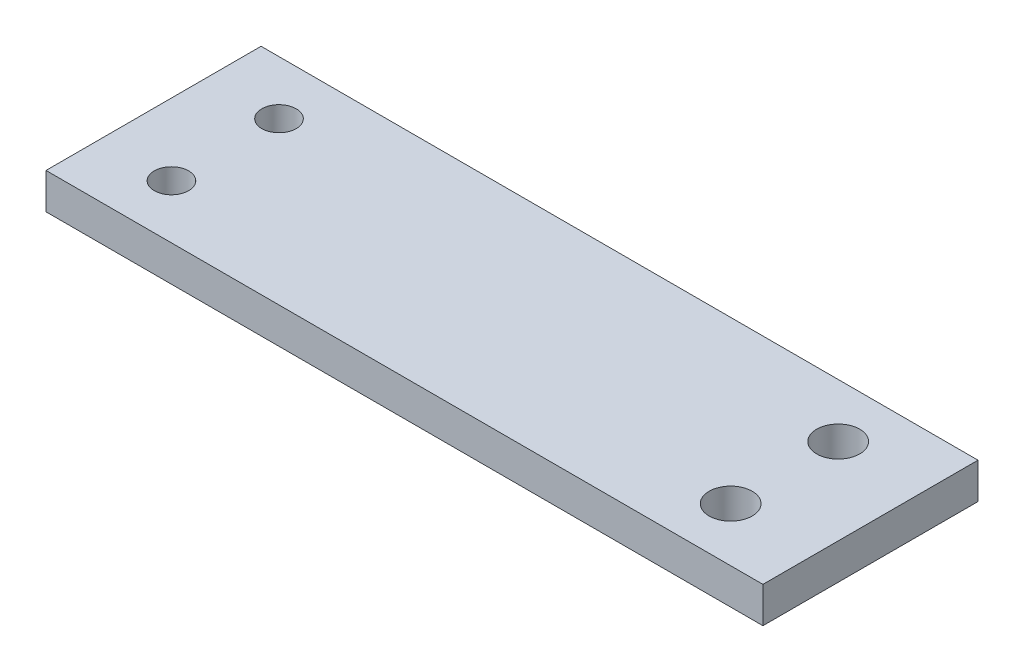
ISO-10303-21;
HEADER;
FILE_DESCRIPTION(('STEP AP214'),'2;1');
FILE_NAME('part.step','',(''),(''),'','','');
FILE_SCHEMA(('AUTOMOTIVE_DESIGN { 1 0 10303 214 1 1 1 1 }'));
ENDSEC;
DATA;
#1=APPLICATION_CONTEXT('core data for automotive mechanical design processes');
#2=APPLICATION_PROTOCOL_DEFINITION('international standard','automotive_design',2000,#1);
#3=PRODUCT_CONTEXT('',#1,'mechanical');
#4=PRODUCT('Part','Part','',(#3));
#5=PRODUCT_RELATED_PRODUCT_CATEGORY('part','',(#4));
#6=PRODUCT_DEFINITION_FORMATION('','',#4);
#7=PRODUCT_DEFINITION_CONTEXT('part definition',#1,'design');
#8=PRODUCT_DEFINITION('design','',#6,#7);
#9=PRODUCT_DEFINITION_SHAPE('','',#8);
#10=(LENGTH_UNIT() NAMED_UNIT(*) SI_UNIT(.MILLI.,.METRE.));
#11=(NAMED_UNIT(*) PLANE_ANGLE_UNIT() SI_UNIT($,.RADIAN.));
#12=(NAMED_UNIT(*) SI_UNIT($,.STERADIAN.) SOLID_ANGLE_UNIT());
#13=UNCERTAINTY_MEASURE_WITH_UNIT(LENGTH_MEASURE(1.E-05),#10,'distance_accuracy_value','');
#14=(GEOMETRIC_REPRESENTATION_CONTEXT(3) GLOBAL_UNCERTAINTY_ASSIGNED_CONTEXT((#13)) GLOBAL_UNIT_ASSIGNED_CONTEXT((#10,
#11,#12)) REPRESENTATION_CONTEXT('',''));
#15=CARTESIAN_POINT('',(0.,0.,0.));
#16=DIRECTION('',(0.,0.,1.));
#17=DIRECTION('',(1.,0.,0.));
#18=AXIS2_PLACEMENT_3D('',#15,#16,#17);
#19=CARTESIAN_POINT('',(-35.,21.,15.));
#20=DIRECTION('',(1.,0.,0.));
#21=DIRECTION('',(0.,0.,-1.));
#22=AXIS2_PLACEMENT_3D('',#19,#20,#21);
#23=PLANE('',#22);
#24=DIRECTION('',(0.,0.,-1.));
#25=VECTOR('',#24,1.);
#26=CARTESIAN_POINT('',(-35.,21.,15.));
#27=LINE('',#26,#25);
#28=CARTESIAN_POINT('',(-35.,21.,15.));
#29=VERTEX_POINT('',#28);
#30=CARTESIAN_POINT('',(-35.,21.,-15.));
#31=VERTEX_POINT('',#30);
#32=EDGE_CURVE('E96',#29,#31,#27,.T.);
#33=ORIENTED_EDGE('',*,*,#32,.T.);
#34=DIRECTION('',(0.,-1.,0.));
#35=VECTOR('',#34,1.);
#36=CARTESIAN_POINT('',(-35.,21.,-15.));
#37=LINE('',#36,#35);
#38=CARTESIAN_POINT('',(-35.,16.,-15.));
#39=VERTEX_POINT('',#38);
#40=EDGE_CURVE('E91',#31,#39,#37,.T.);
#41=ORIENTED_EDGE('',*,*,#40,.T.);
#42=DIRECTION('',(0.,0.,-1.));
#43=VECTOR('',#42,1.);
#44=CARTESIAN_POINT('',(-35.,16.,15.));
#45=LINE('',#44,#43);
#46=CARTESIAN_POINT('',(-35.,16.,15.));
#47=VERTEX_POINT('',#46);
#48=EDGE_CURVE('E11',#47,#39,#45,.T.);
#49=ORIENTED_EDGE('',*,*,#48,.F.);
#50=DIRECTION('',(0.,-1.,0.));
#51=VECTOR('',#50,1.);
#52=CARTESIAN_POINT('',(-35.,21.,15.));
#53=LINE('',#52,#51);
#54=EDGE_CURVE('E107',#29,#47,#53,.T.);
#55=ORIENTED_EDGE('',*,*,#54,.F.);
#56=EDGE_LOOP('',(#33,#41,#49,#55));
#57=FACE_BOUND('',#56,.T.);
#58=ADVANCED_FACE('F39',(#57),#23,.F.);
#59=CARTESIAN_POINT('',(-35.,16.,15.));
#60=DIRECTION('',(0.,1.,0.));
#61=DIRECTION('',(0.,0.,1.));
#62=AXIS2_PLACEMENT_3D('',#59,#60,#61);
#63=PLANE('',#62);
#64=CARTESIAN_POINT('',(-25.,16.,-7.5));
#65=DIRECTION('',(0.,1.,0.));
#66=DIRECTION('',(0.,0.,1.));
#67=AXIS2_PLACEMENT_3D('',#64,#65,#66);
#68=CIRCLE('',#67,2.4);
#69=CARTESIAN_POINT('',(-25.,16.,-5.1));
#70=VERTEX_POINT('',#69);
#71=EDGE_CURVE('E142',#70,#70,#68,.F.);
#72=ORIENTED_EDGE('',*,*,#71,.F.);
#73=EDGE_LOOP('',(#72));
#74=FACE_BOUND('',#73,.T.);
#75=CARTESIAN_POINT('',(-25.,16.,7.5));
#76=DIRECTION('',(0.,1.,0.));
#77=DIRECTION('',(0.,0.,1.));
#78=AXIS2_PLACEMENT_3D('',#75,#76,#77);
#79=CIRCLE('',#78,2.4);
#80=CARTESIAN_POINT('',(-25.,16.,9.9));
#81=VERTEX_POINT('',#80);
#82=EDGE_CURVE('E146',#81,#81,#79,.F.);
#83=ORIENTED_EDGE('',*,*,#82,.F.);
#84=EDGE_LOOP('',(#83));
#85=FACE_BOUND('',#84,.T.);
#86=CARTESIAN_POINT('',(53.,16.,-7.5));
#87=DIRECTION('',(0.,1.,0.));
#88=DIRECTION('',(0.,0.,1.));
#89=AXIS2_PLACEMENT_3D('',#86,#87,#88);
#90=CIRCLE('',#89,3.);
#91=CARTESIAN_POINT('',(53.,16.,-4.5));
#92=VERTEX_POINT('',#91);
#93=EDGE_CURVE('E97',#92,#92,#90,.F.);
#94=ORIENTED_EDGE('',*,*,#93,.F.);
#95=EDGE_LOOP('',(#94));
#96=FACE_BOUND('',#95,.T.);
#97=CARTESIAN_POINT('',(53.,16.,7.5));
#98=DIRECTION('',(0.,1.,0.));
#99=DIRECTION('',(0.,0.,1.));
#100=AXIS2_PLACEMENT_3D('',#97,#98,#99);
#101=CIRCLE('',#100,3.);
#102=CARTESIAN_POINT('',(53.,16.,10.5));
#103=VERTEX_POINT('',#102);
#104=EDGE_CURVE('E100',#103,#103,#101,.F.);
#105=ORIENTED_EDGE('',*,*,#104,.F.);
#106=EDGE_LOOP('',(#105));
#107=FACE_BOUND('',#106,.T.);
#108=ORIENTED_EDGE('',*,*,#48,.T.);
#109=DIRECTION('',(1.,0.,0.));
#110=VECTOR('',#109,1.);
#111=CARTESIAN_POINT('',(-35.,16.,-15.));
#112=LINE('',#111,#110);
#113=CARTESIAN_POINT('',(65.,16.,-15.));
#114=VERTEX_POINT('',#113);
#115=EDGE_CURVE('E81',#39,#114,#112,.T.);
#116=ORIENTED_EDGE('',*,*,#115,.T.);
#117=DIRECTION('',(0.,0.,-1.));
#118=VECTOR('',#117,1.);
#119=CARTESIAN_POINT('',(65.,16.,15.));
#120=LINE('',#119,#118);
#121=CARTESIAN_POINT('',(65.,16.,15.));
#122=VERTEX_POINT('',#121);
#123=EDGE_CURVE('E46',#122,#114,#120,.T.);
#124=ORIENTED_EDGE('',*,*,#123,.F.);
#125=DIRECTION('',(1.,0.,0.));
#126=VECTOR('',#125,1.);
#127=CARTESIAN_POINT('',(-35.,16.,15.));
#128=LINE('',#127,#126);
#129=EDGE_CURVE('E82',#47,#122,#128,.T.);
#130=ORIENTED_EDGE('',*,*,#129,.F.);
#131=EDGE_LOOP('',(#108,#116,#124,#130));
#132=FACE_BOUND('',#131,.T.);
#133=ADVANCED_FACE('F79',(#74,#85,#96,#107,#132),#63,.F.);
#134=CARTESIAN_POINT('',(65.,21.,15.));
#135=DIRECTION('',(-1.,0.,0.));
#136=DIRECTION('',(0.,0.,1.));
#137=AXIS2_PLACEMENT_3D('',#134,#135,#136);
#138=PLANE('',#137);
#139=ORIENTED_EDGE('',*,*,#123,.T.);
#140=DIRECTION('',(0.,1.,0.));
#141=VECTOR('',#140,1.);
#142=CARTESIAN_POINT('',(65.,21.,-15.));
#143=LINE('',#142,#141);
#144=CARTESIAN_POINT('',(65.,21.,-15.));
#145=VERTEX_POINT('',#144);
#146=EDGE_CURVE('E94',#114,#145,#143,.T.);
#147=ORIENTED_EDGE('',*,*,#146,.T.);
#148=DIRECTION('',(0.,0.,-1.));
#149=VECTOR('',#148,1.);
#150=CARTESIAN_POINT('',(65.,21.,15.));
#151=LINE('',#150,#149);
#152=CARTESIAN_POINT('',(65.,21.,15.));
#153=VERTEX_POINT('',#152);
#154=EDGE_CURVE('E113',#153,#145,#151,.T.);
#155=ORIENTED_EDGE('',*,*,#154,.F.);
#156=DIRECTION('',(0.,1.,0.));
#157=VECTOR('',#156,1.);
#158=CARTESIAN_POINT('',(65.,21.,15.));
#159=LINE('',#158,#157);
#160=EDGE_CURVE('E58',#122,#153,#159,.T.);
#161=ORIENTED_EDGE('',*,*,#160,.F.);
#162=EDGE_LOOP('',(#139,#147,#155,#161));
#163=FACE_BOUND('',#162,.T.);
#164=ADVANCED_FACE('F115',(#163),#138,.F.);
#165=CARTESIAN_POINT('',(-35.,21.,15.));
#166=DIRECTION('',(0.,-1.,0.));
#167=DIRECTION('',(1.,0.,0.));
#168=AXIS2_PLACEMENT_3D('',#165,#166,#167);
#169=PLANE('',#168);
#170=CARTESIAN_POINT('',(-25.,21.,-7.5));
#171=DIRECTION('',(0.,-1.,0.));
#172=DIRECTION('',(1.,0.,0.));
#173=AXIS2_PLACEMENT_3D('',#170,#171,#172);
#174=CIRCLE('',#173,2.4);
#175=CARTESIAN_POINT('',(-22.6,21.,-7.5));
#176=VERTEX_POINT('',#175);
#177=EDGE_CURVE('E161',#176,#176,#174,.T.);
#178=ORIENTED_EDGE('',*,*,#177,.T.);
#179=EDGE_LOOP('',(#178));
#180=FACE_BOUND('',#179,.T.);
#181=CARTESIAN_POINT('',(-25.,21.,7.5));
#182=DIRECTION('',(0.,-1.,0.));
#183=DIRECTION('',(1.,0.,0.));
#184=AXIS2_PLACEMENT_3D('',#181,#182,#183);
#185=CIRCLE('',#184,2.4);
#186=CARTESIAN_POINT('',(-22.6,21.,7.5));
#187=VERTEX_POINT('',#186);
#188=EDGE_CURVE('E162',#187,#187,#185,.T.);
#189=ORIENTED_EDGE('',*,*,#188,.T.);
#190=EDGE_LOOP('',(#189));
#191=FACE_BOUND('',#190,.T.);
#192=CARTESIAN_POINT('',(53.,21.,-7.5));
#193=DIRECTION('',(0.,-1.,0.));
#194=DIRECTION('',(1.,0.,0.));
#195=AXIS2_PLACEMENT_3D('',#192,#193,#194);
#196=CIRCLE('',#195,3.);
#197=CARTESIAN_POINT('',(56.,21.,-7.5));
#198=VERTEX_POINT('',#197);
#199=EDGE_CURVE('E152',#198,#198,#196,.T.);
#200=ORIENTED_EDGE('',*,*,#199,.T.);
#201=EDGE_LOOP('',(#200));
#202=FACE_BOUND('',#201,.T.);
#203=CARTESIAN_POINT('',(53.,21.,7.5));
#204=DIRECTION('',(0.,-1.,0.));
#205=DIRECTION('',(1.,0.,0.));
#206=AXIS2_PLACEMENT_3D('',#203,#204,#205);
#207=CIRCLE('',#206,3.);
#208=CARTESIAN_POINT('',(56.,21.,7.5));
#209=VERTEX_POINT('',#208);
#210=EDGE_CURVE('E154',#209,#209,#207,.T.);
#211=ORIENTED_EDGE('',*,*,#210,.T.);
#212=EDGE_LOOP('',(#211));
#213=FACE_BOUND('',#212,.T.);
#214=ORIENTED_EDGE('',*,*,#154,.T.);
#215=DIRECTION('',(-1.,0.,0.));
#216=VECTOR('',#215,1.);
#217=CARTESIAN_POINT('',(-35.,21.,-15.));
#218=LINE('',#217,#216);
#219=EDGE_CURVE('E105',#145,#31,#218,.T.);
#220=ORIENTED_EDGE('',*,*,#219,.T.);
#221=ORIENTED_EDGE('',*,*,#32,.F.);
#222=DIRECTION('',(-1.,0.,0.));
#223=VECTOR('',#222,1.);
#224=CARTESIAN_POINT('',(-35.,21.,15.));
#225=LINE('',#224,#223);
#226=EDGE_CURVE('E53',#153,#29,#225,.T.);
#227=ORIENTED_EDGE('',*,*,#226,.F.);
#228=EDGE_LOOP('',(#214,#220,#221,#227));
#229=FACE_BOUND('',#228,.T.);
#230=ADVANCED_FACE('F117',(#180,#191,#202,#213,#229),#169,.F.);
#231=CARTESIAN_POINT('',(0.,0.,15.));
#232=DIRECTION('',(0.,0.,1.));
#233=DIRECTION('',(1.,0.,0.));
#234=AXIS2_PLACEMENT_3D('',#231,#232,#233);
#235=PLANE('',#234);
#236=ORIENTED_EDGE('',*,*,#54,.T.);
#237=ORIENTED_EDGE('',*,*,#129,.T.);
#238=ORIENTED_EDGE('',*,*,#160,.T.);
#239=ORIENTED_EDGE('',*,*,#226,.T.);
#240=EDGE_LOOP('',(#236,#237,#238,#239));
#241=FACE_BOUND('',#240,.T.);
#242=ADVANCED_FACE('F118',(#241),#235,.T.);
#243=CARTESIAN_POINT('',(0.,0.,-15.));
#244=DIRECTION('',(0.,0.,1.));
#245=DIRECTION('',(1.,0.,0.));
#246=AXIS2_PLACEMENT_3D('',#243,#244,#245);
#247=PLANE('',#246);
#248=ORIENTED_EDGE('',*,*,#40,.F.);
#249=ORIENTED_EDGE('',*,*,#219,.F.);
#250=ORIENTED_EDGE('',*,*,#146,.F.);
#251=ORIENTED_EDGE('',*,*,#115,.F.);
#252=EDGE_LOOP('',(#248,#249,#250,#251));
#253=FACE_BOUND('',#252,.T.);
#254=ADVANCED_FACE('F89',(#253),#247,.F.);
#255=CARTESIAN_POINT('',(53.,29.4852813742386,7.5));
#256=DIRECTION('',(0.,-1.,0.));
#257=DIRECTION('',(0.,0.,-1.));
#258=AXIS2_PLACEMENT_3D('',#255,#256,#257);
#259=CYLINDRICAL_SURFACE('',#258,3.);
#260=ORIENTED_EDGE('',*,*,#210,.F.);
#261=EDGE_LOOP('',(#260));
#262=FACE_BOUND('',#261,.T.);
#263=ORIENTED_EDGE('',*,*,#104,.T.);
#264=EDGE_LOOP('',(#263));
#265=FACE_BOUND('',#264,.T.);
#266=ADVANCED_FACE('F125',(#262,#265),#259,.F.);
#267=CARTESIAN_POINT('',(53.,29.4852813742386,-7.5));
#268=DIRECTION('',(0.,-1.,0.));
#269=DIRECTION('',(0.,0.,-1.));
#270=AXIS2_PLACEMENT_3D('',#267,#268,#269);
#271=CYLINDRICAL_SURFACE('',#270,3.);
#272=ORIENTED_EDGE('',*,*,#199,.F.);
#273=EDGE_LOOP('',(#272));
#274=FACE_BOUND('',#273,.T.);
#275=ORIENTED_EDGE('',*,*,#93,.T.);
#276=EDGE_LOOP('',(#275));
#277=FACE_BOUND('',#276,.T.);
#278=ADVANCED_FACE('F177',(#274,#277),#271,.F.);
#279=CARTESIAN_POINT('',(-25.,27.7882250993908,7.5));
#280=DIRECTION('',(0.,-1.,0.));
#281=DIRECTION('',(0.,0.,-1.));
#282=AXIS2_PLACEMENT_3D('',#279,#280,#281);
#283=CYLINDRICAL_SURFACE('',#282,2.4);
#284=ORIENTED_EDGE('',*,*,#188,.F.);
#285=EDGE_LOOP('',(#284));
#286=FACE_BOUND('',#285,.T.);
#287=ORIENTED_EDGE('',*,*,#82,.T.);
#288=EDGE_LOOP('',(#287));
#289=FACE_BOUND('',#288,.T.);
#290=ADVANCED_FACE('F172',(#286,#289),#283,.F.);
#291=CARTESIAN_POINT('',(-25.,27.7882250993908,-7.5));
#292=DIRECTION('',(0.,-1.,0.));
#293=DIRECTION('',(0.,0.,-1.));
#294=AXIS2_PLACEMENT_3D('',#291,#292,#293);
#295=CYLINDRICAL_SURFACE('',#294,2.4);
#296=ORIENTED_EDGE('',*,*,#177,.F.);
#297=EDGE_LOOP('',(#296));
#298=FACE_BOUND('',#297,.T.);
#299=ORIENTED_EDGE('',*,*,#71,.T.);
#300=EDGE_LOOP('',(#299));
#301=FACE_BOUND('',#300,.T.);
#302=ADVANCED_FACE('F169',(#298,#301),#295,.F.);
#303=CLOSED_SHELL('',(#58,#133,#164,#230,#242,#254,#266,#278,#290,#302));
#304=MANIFOLD_SOLID_BREP('B2',#303);
#305=ADVANCED_BREP_SHAPE_REPRESENTATION('',(#18,#304),#14);
#306=SHAPE_DEFINITION_REPRESENTATION(#9,#305);
ENDSEC;
END-ISO-10303-21;
